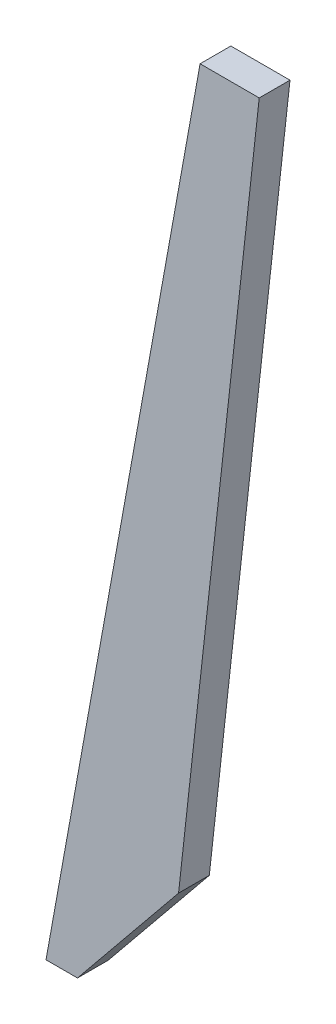
ISO-10303-21;
HEADER;
FILE_DESCRIPTION(('STEP AP214'),'2;1');
FILE_NAME('part.step','',(''),(''),'','','');
FILE_SCHEMA(('AUTOMOTIVE_DESIGN { 1 0 10303 214 1 1 1 1 }'));
ENDSEC;
DATA;
#1=APPLICATION_CONTEXT('core data for automotive mechanical design processes');
#2=APPLICATION_PROTOCOL_DEFINITION('international standard','automotive_design',2000,#1);
#3=PRODUCT_CONTEXT('',#1,'mechanical');
#4=PRODUCT('Part','Part','',(#3));
#5=PRODUCT_RELATED_PRODUCT_CATEGORY('part','',(#4));
#6=PRODUCT_DEFINITION_FORMATION('','',#4);
#7=PRODUCT_DEFINITION_CONTEXT('part definition',#1,'design');
#8=PRODUCT_DEFINITION('design','',#6,#7);
#9=PRODUCT_DEFINITION_SHAPE('','',#8);
#10=(LENGTH_UNIT() NAMED_UNIT(*) SI_UNIT(.MILLI.,.METRE.));
#11=(NAMED_UNIT(*) PLANE_ANGLE_UNIT() SI_UNIT($,.RADIAN.));
#12=(NAMED_UNIT(*) SI_UNIT($,.STERADIAN.) SOLID_ANGLE_UNIT());
#13=UNCERTAINTY_MEASURE_WITH_UNIT(LENGTH_MEASURE(1.E-05),#10,'distance_accuracy_value','');
#14=(GEOMETRIC_REPRESENTATION_CONTEXT(3) GLOBAL_UNCERTAINTY_ASSIGNED_CONTEXT((#13)) GLOBAL_UNIT_ASSIGNED_CONTEXT((#10,
#11,#12)) REPRESENTATION_CONTEXT('',''));
#15=CARTESIAN_POINT('',(0.,0.,0.));
#16=DIRECTION('',(0.,0.,1.));
#17=DIRECTION('',(1.,0.,0.));
#18=AXIS2_PLACEMENT_3D('',#15,#16,#17);
#19=CARTESIAN_POINT('',(371.734942748036,416.,15.));
#20=DIRECTION('',(0.,-1.,0.));
#21=DIRECTION('',(0.,0.,-1.));
#22=AXIS2_PLACEMENT_3D('',#19,#20,#21);
#23=PLANE('',#22);
#24=DIRECTION('',(-1.,0.,0.));
#25=VECTOR('',#24,1.);
#26=CARTESIAN_POINT('',(371.734942748036,416.,0.));
#27=LINE('',#26,#25);
#28=CARTESIAN_POINT('',(400.577201165022,416.,0.));
#29=VERTEX_POINT('',#28);
#30=CARTESIAN_POINT('',(371.734942748036,416.,0.));
#31=VERTEX_POINT('',#30);
#32=EDGE_CURVE('E109',#29,#31,#27,.T.);
#33=ORIENTED_EDGE('',*,*,#32,.T.);
#34=DIRECTION('',(0.,0.,-1.));
#35=VECTOR('',#34,1.);
#36=CARTESIAN_POINT('',(371.734942748036,416.,15.));
#37=LINE('',#36,#35);
#38=CARTESIAN_POINT('',(371.734942748036,416.,15.));
#39=VERTEX_POINT('',#38);
#40=EDGE_CURVE('E11',#39,#31,#37,.T.);
#41=ORIENTED_EDGE('',*,*,#40,.F.);
#42=DIRECTION('',(-1.,0.,0.));
#43=VECTOR('',#42,1.);
#44=CARTESIAN_POINT('',(371.734942748036,416.,15.));
#45=LINE('',#44,#43);
#46=CARTESIAN_POINT('',(400.577201165022,416.,15.));
#47=VERTEX_POINT('',#46);
#48=EDGE_CURVE('E117',#47,#39,#45,.T.);
#49=ORIENTED_EDGE('',*,*,#48,.F.);
#50=DIRECTION('',(0.,0.,-1.));
#51=VECTOR('',#50,1.);
#52=CARTESIAN_POINT('',(400.577201165022,416.,15.));
#53=LINE('',#52,#51);
#54=EDGE_CURVE('E105',#47,#29,#53,.T.);
#55=ORIENTED_EDGE('',*,*,#54,.T.);
#56=EDGE_LOOP('',(#33,#41,#49,#55));
#57=FACE_BOUND('',#56,.T.);
#58=ADVANCED_FACE('F35',(#57),#23,.F.);
#59=CARTESIAN_POINT('',(296.597151768925,0.,15.));
#60=DIRECTION('',(0.984076823550579,-0.177743650661851,0.));
#61=DIRECTION('',(0.177743650661851,0.984076823550579,0.));
#62=AXIS2_PLACEMENT_3D('',#59,#60,#61);
#63=PLANE('',#62);
#64=DIRECTION('',(-0.177743650661851,-0.984076823550579,0.));
#65=VECTOR('',#64,1.);
#66=CARTESIAN_POINT('',(296.597151768925,0.,0.));
#67=LINE('',#66,#65);
#68=CARTESIAN_POINT('',(296.597151768925,0.,0.));
#69=VERTEX_POINT('',#68);
#70=EDGE_CURVE('E112',#31,#69,#67,.T.);
#71=ORIENTED_EDGE('',*,*,#70,.T.);
#72=DIRECTION('',(0.,0.,-1.));
#73=VECTOR('',#72,1.);
#74=CARTESIAN_POINT('',(296.597151768925,0.,15.));
#75=LINE('',#74,#73);
#76=CARTESIAN_POINT('',(296.597151768925,0.,15.));
#77=VERTEX_POINT('',#76);
#78=EDGE_CURVE('E43',#77,#69,#75,.T.);
#79=ORIENTED_EDGE('',*,*,#78,.F.);
#80=DIRECTION('',(-0.177743650661851,-0.984076823550579,0.));
#81=VECTOR('',#80,1.);
#82=CARTESIAN_POINT('',(296.597151768925,0.,15.));
#83=LINE('',#82,#81);
#84=EDGE_CURVE('E85',#39,#77,#83,.T.);
#85=ORIENTED_EDGE('',*,*,#84,.F.);
#86=ORIENTED_EDGE('',*,*,#40,.T.);
#87=EDGE_LOOP('',(#71,#79,#85,#86));
#88=FACE_BOUND('',#87,.T.);
#89=ADVANCED_FACE('F136',(#88),#63,.F.);
#90=CARTESIAN_POINT('',(311.944825714503,0.,15.));
#91=DIRECTION('',(0.,1.,0.));
#92=DIRECTION('',(-1.,0.,0.));
#93=AXIS2_PLACEMENT_3D('',#90,#91,#92);
#94=PLANE('',#93);
#95=DIRECTION('',(1.,0.,0.));
#96=VECTOR('',#95,1.);
#97=CARTESIAN_POINT('',(311.944825714503,0.,0.));
#98=LINE('',#97,#96);
#99=CARTESIAN_POINT('',(311.944825714503,0.,0.));
#100=VERTEX_POINT('',#99);
#101=EDGE_CURVE('E100',#69,#100,#98,.T.);
#102=ORIENTED_EDGE('',*,*,#101,.T.);
#103=DIRECTION('',(0.,0.,-1.));
#104=VECTOR('',#103,1.);
#105=CARTESIAN_POINT('',(311.944825714503,0.,15.));
#106=LINE('',#105,#104);
#107=CARTESIAN_POINT('',(311.944825714503,0.,15.));
#108=VERTEX_POINT('',#107);
#109=EDGE_CURVE('E97',#108,#100,#106,.T.);
#110=ORIENTED_EDGE('',*,*,#109,.F.);
#111=DIRECTION('',(1.,0.,0.));
#112=VECTOR('',#111,1.);
#113=CARTESIAN_POINT('',(311.944825714503,0.,15.));
#114=LINE('',#113,#112);
#115=EDGE_CURVE('E89',#77,#108,#114,.T.);
#116=ORIENTED_EDGE('',*,*,#115,.F.);
#117=ORIENTED_EDGE('',*,*,#78,.T.);
#118=EDGE_LOOP('',(#102,#110,#116,#117));
#119=FACE_BOUND('',#118,.T.);
#120=ADVANCED_FACE('F98',(#119),#94,.F.);
#121=CARTESIAN_POINT('',(311.944825714503,0.,15.));
#122=DIRECTION('',(-0.775230120030378,0.631678922394666,0.));
#123=DIRECTION('',(-0.631678922394666,-0.775230120030378,0.));
#124=AXIS2_PLACEMENT_3D('',#121,#122,#123);
#125=PLANE('',#124);
#126=DIRECTION('',(0.631678922394665,0.775230120030378,0.));
#127=VECTOR('',#126,1.);
#128=CARTESIAN_POINT('',(311.944825714503,0.,0.));
#129=LINE('',#128,#127);
#130=CARTESIAN_POINT('',(361.233423479004,60.4896003435587,0.));
#131=VERTEX_POINT('',#130);
#132=EDGE_CURVE('E71',#100,#131,#129,.T.);
#133=ORIENTED_EDGE('',*,*,#132,.T.);
#134=DIRECTION('',(0.,0.,-1.));
#135=VECTOR('',#134,1.);
#136=CARTESIAN_POINT('',(361.233423479004,60.4896003435587,15.));
#137=LINE('',#136,#135);
#138=CARTESIAN_POINT('',(361.233423479004,60.4896003435587,15.));
#139=VERTEX_POINT('',#138);
#140=EDGE_CURVE('E101',#139,#131,#137,.T.);
#141=ORIENTED_EDGE('',*,*,#140,.F.);
#142=DIRECTION('',(0.631678922394665,0.775230120030378,0.));
#143=VECTOR('',#142,1.);
#144=CARTESIAN_POINT('',(311.944825714503,0.,15.));
#145=LINE('',#144,#143);
#146=EDGE_CURVE('E93',#108,#139,#145,.T.);
#147=ORIENTED_EDGE('',*,*,#146,.F.);
#148=ORIENTED_EDGE('',*,*,#109,.T.);
#149=EDGE_LOOP('',(#133,#141,#147,#148));
#150=FACE_BOUND('',#149,.T.);
#151=ADVANCED_FACE('F103',(#150),#125,.F.);
#152=CARTESIAN_POINT('',(400.577201165022,416.,15.));
#153=DIRECTION('',(-0.993931931791742,0.109996886159276,0.));
#154=DIRECTION('',(-0.109996886159276,-0.993931931791742,0.));
#155=AXIS2_PLACEMENT_3D('',#152,#153,#154);
#156=PLANE('',#155);
#157=DIRECTION('',(0.109996886159276,0.993931931791742,0.));
#158=VECTOR('',#157,1.);
#159=CARTESIAN_POINT('',(400.577201165022,416.,0.));
#160=LINE('',#159,#158);
#161=EDGE_CURVE('E77',#131,#29,#160,.T.);
#162=ORIENTED_EDGE('',*,*,#161,.T.);
#163=ORIENTED_EDGE('',*,*,#54,.F.);
#164=DIRECTION('',(0.109996886159276,0.993931931791742,0.));
#165=VECTOR('',#164,1.);
#166=CARTESIAN_POINT('',(400.577201165022,416.,15.));
#167=LINE('',#166,#165);
#168=EDGE_CURVE('E51',#139,#47,#167,.T.);
#169=ORIENTED_EDGE('',*,*,#168,.F.);
#170=ORIENTED_EDGE('',*,*,#140,.T.);
#171=EDGE_LOOP('',(#162,#163,#169,#170));
#172=FACE_BOUND('',#171,.T.);
#173=ADVANCED_FACE('F125',(#172),#156,.F.);
#174=CARTESIAN_POINT('',(0.,0.,15.));
#175=DIRECTION('',(0.,0.,-1.));
#176=DIRECTION('',(-1.,0.,0.));
#177=AXIS2_PLACEMENT_3D('',#174,#175,#176);
#178=PLANE('',#177);
#179=ORIENTED_EDGE('',*,*,#48,.T.);
#180=ORIENTED_EDGE('',*,*,#84,.T.);
#181=ORIENTED_EDGE('',*,*,#115,.T.);
#182=ORIENTED_EDGE('',*,*,#146,.T.);
#183=ORIENTED_EDGE('',*,*,#168,.T.);
#184=EDGE_LOOP('',(#179,#180,#181,#182,#183));
#185=FACE_BOUND('',#184,.T.);
#186=ADVANCED_FACE('F91',(#185),#178,.F.);
#187=CARTESIAN_POINT('',(0.,0.,0.));
#188=DIRECTION('',(0.,0.,-1.));
#189=DIRECTION('',(-1.,0.,0.));
#190=AXIS2_PLACEMENT_3D('',#187,#188,#189);
#191=PLANE('',#190);
#192=ORIENTED_EDGE('',*,*,#32,.F.);
#193=ORIENTED_EDGE('',*,*,#161,.F.);
#194=ORIENTED_EDGE('',*,*,#132,.F.);
#195=ORIENTED_EDGE('',*,*,#101,.F.);
#196=ORIENTED_EDGE('',*,*,#70,.F.);
#197=EDGE_LOOP('',(#192,#193,#194,#195,#196));
#198=FACE_BOUND('',#197,.T.);
#199=ADVANCED_FACE('F121',(#198),#191,.T.);
#200=CLOSED_SHELL('',(#58,#89,#120,#151,#173,#186,#199));
#201=MANIFOLD_SOLID_BREP('B2',#200);
#202=ADVANCED_BREP_SHAPE_REPRESENTATION('',(#18,#201),#14);
#203=SHAPE_DEFINITION_REPRESENTATION(#9,#202);
ENDSEC;
END-ISO-10303-21;
